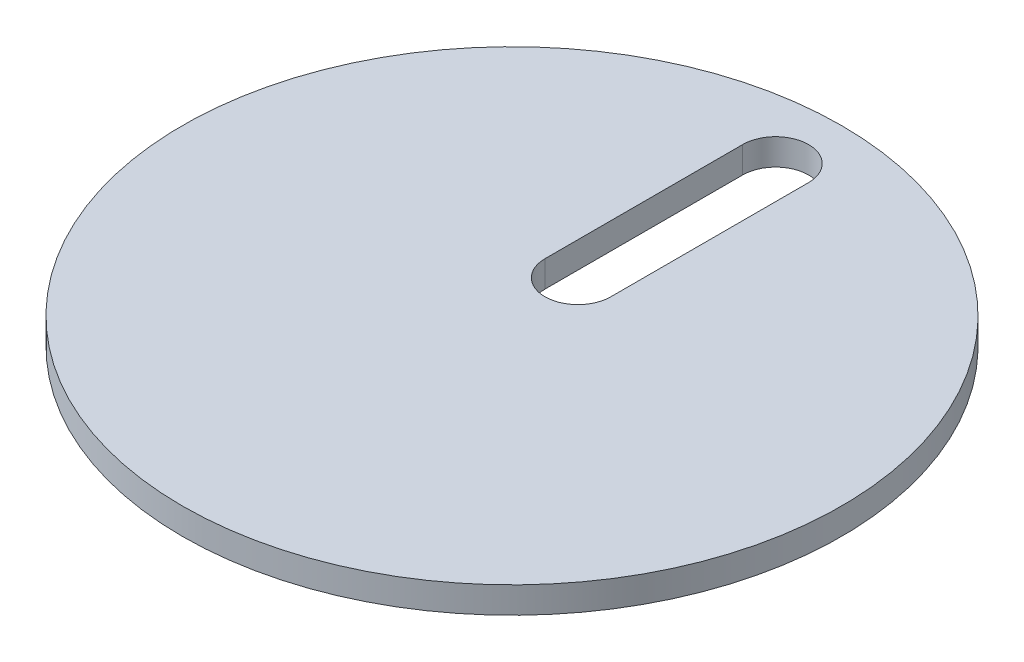
ISO-10303-21;
HEADER;
FILE_DESCRIPTION(('STEP AP214'),'2;1');
FILE_NAME('part.step','',(''),(''),'','','');
FILE_SCHEMA(('AUTOMOTIVE_DESIGN { 1 0 10303 214 1 1 1 1 }'));
ENDSEC;
DATA;
#1=APPLICATION_CONTEXT('core data for automotive mechanical design processes');
#2=APPLICATION_PROTOCOL_DEFINITION('international standard','automotive_design',2000,#1);
#3=PRODUCT_CONTEXT('',#1,'mechanical');
#4=PRODUCT('Part','Part','',(#3));
#5=PRODUCT_RELATED_PRODUCT_CATEGORY('part','',(#4));
#6=PRODUCT_DEFINITION_FORMATION('','',#4);
#7=PRODUCT_DEFINITION_CONTEXT('part definition',#1,'design');
#8=PRODUCT_DEFINITION('design','',#6,#7);
#9=PRODUCT_DEFINITION_SHAPE('','',#8);
#10=(LENGTH_UNIT() NAMED_UNIT(*) SI_UNIT(.MILLI.,.METRE.));
#11=(NAMED_UNIT(*) PLANE_ANGLE_UNIT() SI_UNIT($,.RADIAN.));
#12=(NAMED_UNIT(*) SI_UNIT($,.STERADIAN.) SOLID_ANGLE_UNIT());
#13=UNCERTAINTY_MEASURE_WITH_UNIT(LENGTH_MEASURE(1.E-05),#10,'distance_accuracy_value','');
#14=(GEOMETRIC_REPRESENTATION_CONTEXT(3) GLOBAL_UNCERTAINTY_ASSIGNED_CONTEXT((#13)) GLOBAL_UNIT_ASSIGNED_CONTEXT((#10,
#11,#12)) REPRESENTATION_CONTEXT('',''));
#15=CARTESIAN_POINT('',(0.,0.,0.));
#16=DIRECTION('',(0.,0.,1.));
#17=DIRECTION('',(1.,0.,0.));
#18=AXIS2_PLACEMENT_3D('',#15,#16,#17);
#19=CARTESIAN_POINT('',(0.107420936636628,4.,-7.24306252602686));
#20=DIRECTION('',(0.,1.,0.));
#21=DIRECTION('',(0.,0.,1.));
#22=AXIS2_PLACEMENT_3D('',#19,#20,#21);
#23=PLANE('',#22);
#24=CARTESIAN_POINT('',(0.107420936636628,4.,-7.24306252602686));
#25=DIRECTION('',(0.,1.,0.));
#26=DIRECTION('',(0.,0.,1.));
#27=AXIS2_PLACEMENT_3D('',#24,#25,#26);
#28=CIRCLE('',#27,50.);
#29=CARTESIAN_POINT('',(0.107420936636628,4.,42.7569374739731));
#30=VERTEX_POINT('',#29);
#31=EDGE_CURVE('E11',#30,#30,#28,.T.);
#32=ORIENTED_EDGE('',*,*,#31,.T.);
#33=EDGE_LOOP('',(#32));
#34=FACE_BOUND('',#33,.T.);
#35=DIRECTION('',(0.,0.,-1.));
#36=VECTOR('',#35,1.);
#37=CARTESIAN_POINT('',(5.10742093663663,4.,-17.2430625260269));
#38=LINE('',#37,#36);
#39=CARTESIAN_POINT('',(5.10742093663663,4.,-17.2430625260269));
#40=VERTEX_POINT('',#39);
#41=CARTESIAN_POINT('',(5.10742093663663,4.,-47.2430625260269));
#42=VERTEX_POINT('',#41);
#43=EDGE_CURVE('E82',#40,#42,#38,.T.);
#44=ORIENTED_EDGE('',*,*,#43,.F.);
#45=CARTESIAN_POINT('',(0.107420936636628,4.,-17.2430625260269));
#46=DIRECTION('',(0.,1.,0.));
#47=DIRECTION('',(0.,0.,1.));
#48=AXIS2_PLACEMENT_3D('',#45,#46,#47);
#49=CIRCLE('',#48,5.);
#50=CARTESIAN_POINT('',(-4.89257906336337,4.,-17.2430625260269));
#51=VERTEX_POINT('',#50);
#52=EDGE_CURVE('E74',#51,#40,#49,.T.);
#53=ORIENTED_EDGE('',*,*,#52,.F.);
#54=DIRECTION('',(0.,0.,1.));
#55=VECTOR('',#54,1.);
#56=CARTESIAN_POINT('',(-4.89257906336337,4.,-17.2430625260269));
#57=LINE('',#56,#55);
#58=CARTESIAN_POINT('',(-4.89257906336337,4.,-47.2430625260269));
#59=VERTEX_POINT('',#58);
#60=EDGE_CURVE('E95',#59,#51,#57,.T.);
#61=ORIENTED_EDGE('',*,*,#60,.F.);
#62=CARTESIAN_POINT('',(0.107420936636629,4.,-47.2430625260269));
#63=DIRECTION('',(0.,1.,0.));
#64=DIRECTION('',(0.,0.,1.));
#65=AXIS2_PLACEMENT_3D('',#62,#63,#64);
#66=CIRCLE('',#65,5.);
#67=EDGE_CURVE('E93',#42,#59,#66,.T.);
#68=ORIENTED_EDGE('',*,*,#67,.F.);
#69=EDGE_LOOP('',(#44,#53,#61,#68));
#70=FACE_BOUND('',#69,.T.);
#71=ADVANCED_FACE('F33',(#34,#70),#23,.T.);
#72=CARTESIAN_POINT('',(0.107420936636628,0.,-7.24306252602686));
#73=DIRECTION('',(0.,1.,0.));
#74=DIRECTION('',(0.,0.,1.));
#75=AXIS2_PLACEMENT_3D('',#72,#73,#74);
#76=PLANE('',#75);
#77=CARTESIAN_POINT('',(0.107420936636628,0.,-7.24306252602686));
#78=DIRECTION('',(0.,1.,0.));
#79=DIRECTION('',(0.,0.,1.));
#80=AXIS2_PLACEMENT_3D('',#77,#78,#79);
#81=CIRCLE('',#80,50.);
#82=CARTESIAN_POINT('',(0.107420936636628,0.,42.7569374739731));
#83=VERTEX_POINT('',#82);
#84=EDGE_CURVE('E37',#83,#83,#81,.T.);
#85=ORIENTED_EDGE('',*,*,#84,.F.);
#86=EDGE_LOOP('',(#85));
#87=FACE_BOUND('',#86,.T.);
#88=CARTESIAN_POINT('',(0.107420936636628,0.,-17.2430625260269));
#89=DIRECTION('',(0.,1.,0.));
#90=DIRECTION('',(0.,0.,1.));
#91=AXIS2_PLACEMENT_3D('',#88,#89,#90);
#92=CIRCLE('',#91,5.);
#93=CARTESIAN_POINT('',(-4.89257906336337,0.,-17.2430625260269));
#94=VERTEX_POINT('',#93);
#95=CARTESIAN_POINT('',(5.10742093663663,0.,-17.2430625260269));
#96=VERTEX_POINT('',#95);
#97=EDGE_CURVE('E56',#94,#96,#92,.T.);
#98=ORIENTED_EDGE('',*,*,#97,.T.);
#99=DIRECTION('',(0.,0.,-1.));
#100=VECTOR('',#99,1.);
#101=CARTESIAN_POINT('',(5.10742093663663,0.,-17.2430625260269));
#102=LINE('',#101,#100);
#103=CARTESIAN_POINT('',(5.10742093663663,0.,-47.2430625260269));
#104=VERTEX_POINT('',#103);
#105=EDGE_CURVE('E89',#96,#104,#102,.T.);
#106=ORIENTED_EDGE('',*,*,#105,.T.);
#107=CARTESIAN_POINT('',(0.107420936636629,0.,-47.2430625260269));
#108=DIRECTION('',(0.,1.,0.));
#109=DIRECTION('',(0.,0.,1.));
#110=AXIS2_PLACEMENT_3D('',#107,#108,#109);
#111=CIRCLE('',#110,5.);
#112=CARTESIAN_POINT('',(-4.89257906336337,0.,-47.2430625260269));
#113=VERTEX_POINT('',#112);
#114=EDGE_CURVE('E101',#104,#113,#111,.T.);
#115=ORIENTED_EDGE('',*,*,#114,.T.);
#116=DIRECTION('',(0.,0.,1.));
#117=VECTOR('',#116,1.);
#118=CARTESIAN_POINT('',(-4.89257906336337,0.,-17.2430625260269));
#119=LINE('',#118,#117);
#120=EDGE_CURVE('E83',#113,#94,#119,.T.);
#121=ORIENTED_EDGE('',*,*,#120,.T.);
#122=EDGE_LOOP('',(#98,#106,#115,#121));
#123=FACE_BOUND('',#122,.T.);
#124=ADVANCED_FACE('F112',(#87,#123),#76,.F.);
#125=CARTESIAN_POINT('',(0.107420936636628,4.,-7.24306252602686));
#126=DIRECTION('',(0.,-1.,0.));
#127=DIRECTION('',(0.,0.,-1.));
#128=AXIS2_PLACEMENT_3D('',#125,#126,#127);
#129=CYLINDRICAL_SURFACE('',#128,50.);
#130=ORIENTED_EDGE('',*,*,#31,.F.);
#131=EDGE_LOOP('',(#130));
#132=FACE_BOUND('',#131,.T.);
#133=ORIENTED_EDGE('',*,*,#84,.T.);
#134=EDGE_LOOP('',(#133));
#135=FACE_BOUND('',#134,.T.);
#136=ADVANCED_FACE('F35',(#132,#135),#129,.T.);
#137=CARTESIAN_POINT('',(0.107420936636628,4.,-17.2430625260269));
#138=DIRECTION('',(0.,-1.,0.));
#139=DIRECTION('',(0.,0.,-1.));
#140=AXIS2_PLACEMENT_3D('',#137,#138,#139);
#141=CYLINDRICAL_SURFACE('',#140,5.);
#142=ORIENTED_EDGE('',*,*,#97,.F.);
#143=DIRECTION('',(0.,-1.,0.));
#144=VECTOR('',#143,1.);
#145=CARTESIAN_POINT('',(-4.89257906336337,4.,-17.2430625260269));
#146=LINE('',#145,#144);
#147=EDGE_CURVE('E78',#51,#94,#146,.T.);
#148=ORIENTED_EDGE('',*,*,#147,.F.);
#149=ORIENTED_EDGE('',*,*,#52,.T.);
#150=DIRECTION('',(0.,-1.,0.));
#151=VECTOR('',#150,1.);
#152=CARTESIAN_POINT('',(5.10742093663663,4.,-17.2430625260269));
#153=LINE('',#152,#151);
#154=EDGE_CURVE('E77',#40,#96,#153,.T.);
#155=ORIENTED_EDGE('',*,*,#154,.T.);
#156=EDGE_LOOP('',(#142,#148,#149,#155));
#157=FACE_BOUND('',#156,.T.);
#158=ADVANCED_FACE('F76',(#157),#141,.F.);
#159=CARTESIAN_POINT('',(5.10742093663663,4.,-17.2430625260269));
#160=DIRECTION('',(-1.,0.,0.));
#161=DIRECTION('',(0.,0.,1.));
#162=AXIS2_PLACEMENT_3D('',#159,#160,#161);
#163=PLANE('',#162);
#164=ORIENTED_EDGE('',*,*,#105,.F.);
#165=ORIENTED_EDGE('',*,*,#154,.F.);
#166=ORIENTED_EDGE('',*,*,#43,.T.);
#167=DIRECTION('',(0.,-1.,0.));
#168=VECTOR('',#167,1.);
#169=CARTESIAN_POINT('',(5.10742093663663,4.,-47.2430625260269));
#170=LINE('',#169,#168);
#171=EDGE_CURVE('E90',#42,#104,#170,.T.);
#172=ORIENTED_EDGE('',*,*,#171,.T.);
#173=EDGE_LOOP('',(#164,#165,#166,#172));
#174=FACE_BOUND('',#173,.T.);
#175=ADVANCED_FACE('F86',(#174),#163,.T.);
#176=CARTESIAN_POINT('',(0.107420936636629,4.,-47.2430625260269));
#177=DIRECTION('',(0.,-1.,0.));
#178=DIRECTION('',(0.,0.,-1.));
#179=AXIS2_PLACEMENT_3D('',#176,#177,#178);
#180=CYLINDRICAL_SURFACE('',#179,5.);
#181=ORIENTED_EDGE('',*,*,#114,.F.);
#182=ORIENTED_EDGE('',*,*,#171,.F.);
#183=ORIENTED_EDGE('',*,*,#67,.T.);
#184=DIRECTION('',(0.,-1.,0.));
#185=VECTOR('',#184,1.);
#186=CARTESIAN_POINT('',(-4.89257906336337,4.,-47.2430625260269));
#187=LINE('',#186,#185);
#188=EDGE_CURVE('E48',#59,#113,#187,.T.);
#189=ORIENTED_EDGE('',*,*,#188,.T.);
#190=EDGE_LOOP('',(#181,#182,#183,#189));
#191=FACE_BOUND('',#190,.T.);
#192=ADVANCED_FACE('F110',(#191),#180,.F.);
#193=CARTESIAN_POINT('',(-4.89257906336337,4.,-17.2430625260269));
#194=DIRECTION('',(1.,0.,0.));
#195=DIRECTION('',(0.,0.,-1.));
#196=AXIS2_PLACEMENT_3D('',#193,#194,#195);
#197=PLANE('',#196);
#198=ORIENTED_EDGE('',*,*,#120,.F.);
#199=ORIENTED_EDGE('',*,*,#188,.F.);
#200=ORIENTED_EDGE('',*,*,#60,.T.);
#201=ORIENTED_EDGE('',*,*,#147,.T.);
#202=EDGE_LOOP('',(#198,#199,#200,#201));
#203=FACE_BOUND('',#202,.T.);
#204=ADVANCED_FACE('F113',(#203),#197,.T.);
#205=CLOSED_SHELL('',(#71,#124,#136,#158,#175,#192,#204));
#206=MANIFOLD_SOLID_BREP('B2',#205);
#207=ADVANCED_BREP_SHAPE_REPRESENTATION('',(#18,#206),#14);
#208=SHAPE_DEFINITION_REPRESENTATION(#9,#207);
ENDSEC;
END-ISO-10303-21;
